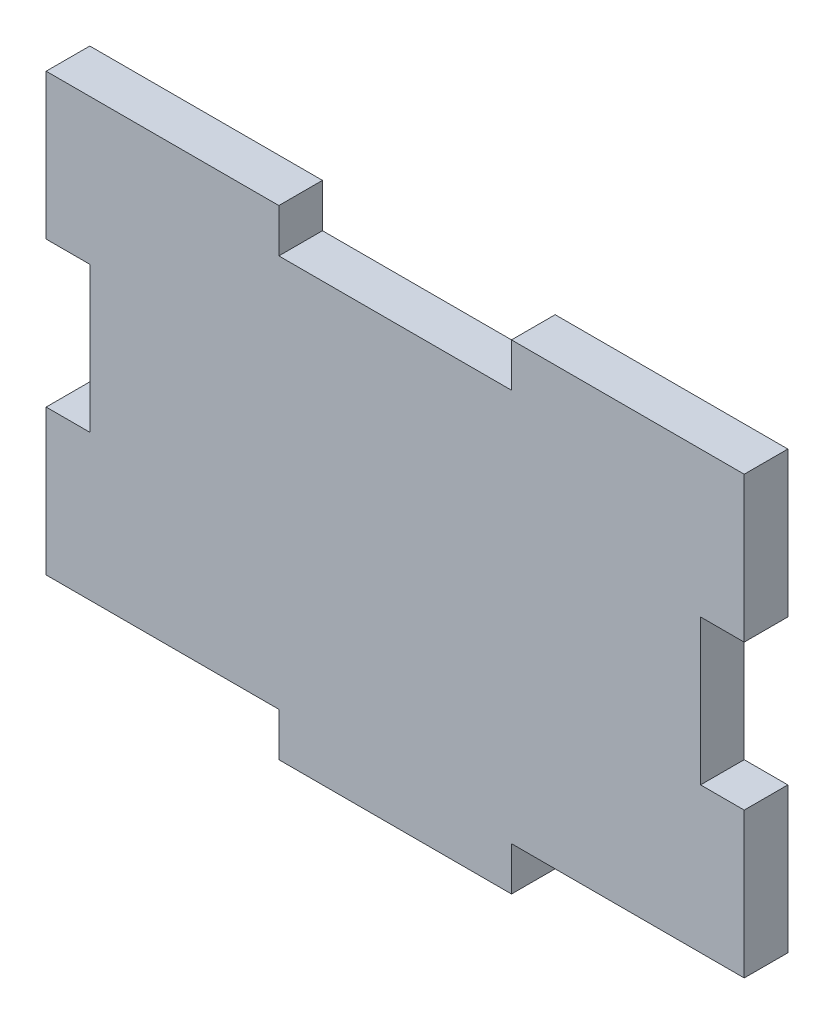
ISO-10303-21;
HEADER;
FILE_DESCRIPTION(('STEP AP214'),'2;1');
FILE_NAME('part.step','',(''),(''),'','','');
FILE_SCHEMA(('AUTOMOTIVE_DESIGN { 1 0 10303 214 1 1 1 1 }'));
ENDSEC;
DATA;
#1=APPLICATION_CONTEXT('core data for automotive mechanical design processes');
#2=APPLICATION_PROTOCOL_DEFINITION('international standard','automotive_design',2000,#1);
#3=PRODUCT_CONTEXT('',#1,'mechanical');
#4=PRODUCT('Part','Part','',(#3));
#5=PRODUCT_RELATED_PRODUCT_CATEGORY('part','',(#4));
#6=PRODUCT_DEFINITION_FORMATION('','',#4);
#7=PRODUCT_DEFINITION_CONTEXT('part definition',#1,'design');
#8=PRODUCT_DEFINITION('design','',#6,#7);
#9=PRODUCT_DEFINITION_SHAPE('','',#8);
#10=(LENGTH_UNIT() NAMED_UNIT(*) SI_UNIT(.MILLI.,.METRE.));
#11=(NAMED_UNIT(*) PLANE_ANGLE_UNIT() SI_UNIT($,.RADIAN.));
#12=(NAMED_UNIT(*) SI_UNIT($,.STERADIAN.) SOLID_ANGLE_UNIT());
#13=UNCERTAINTY_MEASURE_WITH_UNIT(LENGTH_MEASURE(1.E-05),#10,'distance_accuracy_value','');
#14=(GEOMETRIC_REPRESENTATION_CONTEXT(3) GLOBAL_UNCERTAINTY_ASSIGNED_CONTEXT((#13)) GLOBAL_UNIT_ASSIGNED_CONTEXT((#10,
#11,#12)) REPRESENTATION_CONTEXT('',''));
#15=CARTESIAN_POINT('',(0.,0.,0.));
#16=DIRECTION('',(0.,0.,1.));
#17=DIRECTION('',(1.,0.,0.));
#18=AXIS2_PLACEMENT_3D('',#15,#16,#17);
#19=CARTESIAN_POINT('',(0.,55.,5.));
#20=DIRECTION('',(0.,1.,0.));
#21=DIRECTION('',(0.,0.,1.));
#22=AXIS2_PLACEMENT_3D('',#19,#20,#21);
#23=PLANE('',#22);
#24=DIRECTION('',(0.,0.,1.));
#25=VECTOR('',#24,1.);
#26=CARTESIAN_POINT('',(53.3333333333333,55.,-5.));
#27=LINE('',#26,#25);
#28=CARTESIAN_POINT('',(53.3333333333333,55.,0.));
#29=VERTEX_POINT('',#28);
#30=CARTESIAN_POINT('',(53.3333333333333,55.,5.));
#31=VERTEX_POINT('',#30);
#32=EDGE_CURVE('E296',#29,#31,#27,.T.);
#33=ORIENTED_EDGE('',*,*,#32,.T.);
#34=DIRECTION('',(1.,0.,0.));
#35=VECTOR('',#34,1.);
#36=CARTESIAN_POINT('',(0.,55.,5.));
#37=LINE('',#36,#35);
#38=CARTESIAN_POINT('',(80.,55.,5.));
#39=VERTEX_POINT('',#38);
#40=EDGE_CURVE('E182',#31,#39,#37,.T.);
#41=ORIENTED_EDGE('',*,*,#40,.T.);
#42=DIRECTION('',(0.,0.,-1.));
#43=VECTOR('',#42,1.);
#44=CARTESIAN_POINT('',(80.,55.,5.));
#45=LINE('',#44,#43);
#46=CARTESIAN_POINT('',(80.,55.,0.));
#47=VERTEX_POINT('',#46);
#48=EDGE_CURVE('E173',#39,#47,#45,.T.);
#49=ORIENTED_EDGE('',*,*,#48,.T.);
#50=DIRECTION('',(1.,0.,0.));
#51=VECTOR('',#50,1.);
#52=CARTESIAN_POINT('',(0.,55.,0.));
#53=LINE('',#52,#51);
#54=EDGE_CURVE('E232',#29,#47,#53,.T.);
#55=ORIENTED_EDGE('',*,*,#54,.F.);
#56=EDGE_LOOP('',(#33,#41,#49,#55));
#57=FACE_BOUND('',#56,.T.);
#58=ADVANCED_FACE('F35',(#57),#23,.T.);
#59=CARTESIAN_POINT('',(0.,0.,5.));
#60=DIRECTION('',(-1.,0.,0.));
#61=DIRECTION('',(0.,0.,1.));
#62=AXIS2_PLACEMENT_3D('',#59,#60,#61);
#63=PLANE('',#62);
#64=DIRECTION('',(0.,1.,0.));
#65=VECTOR('',#64,1.);
#66=CARTESIAN_POINT('',(0.,0.,0.));
#67=LINE('',#66,#65);
#68=CARTESIAN_POINT('',(0.,38.3333333333333,0.));
#69=VERTEX_POINT('',#68);
#70=CARTESIAN_POINT('',(0.,55.,0.));
#71=VERTEX_POINT('',#70);
#72=EDGE_CURVE('E196',#69,#71,#67,.T.);
#73=ORIENTED_EDGE('',*,*,#72,.F.);
#74=DIRECTION('',(0.,0.,-1.));
#75=VECTOR('',#74,1.);
#76=CARTESIAN_POINT('',(0.,38.3333333333333,5.));
#77=LINE('',#76,#75);
#78=CARTESIAN_POINT('',(0.,38.3333333333333,5.));
#79=VERTEX_POINT('',#78);
#80=EDGE_CURVE('E119',#79,#69,#77,.T.);
#81=ORIENTED_EDGE('',*,*,#80,.F.);
#82=DIRECTION('',(0.,1.,0.));
#83=VECTOR('',#82,1.);
#84=CARTESIAN_POINT('',(0.,0.,5.));
#85=LINE('',#84,#83);
#86=CARTESIAN_POINT('',(0.,55.,5.));
#87=VERTEX_POINT('',#86);
#88=EDGE_CURVE('E236',#79,#87,#85,.T.);
#89=ORIENTED_EDGE('',*,*,#88,.T.);
#90=DIRECTION('',(0.,0.,-1.));
#91=VECTOR('',#90,1.);
#92=CARTESIAN_POINT('',(0.,55.,5.));
#93=LINE('',#92,#91);
#94=EDGE_CURVE('E59',#87,#71,#93,.T.);
#95=ORIENTED_EDGE('',*,*,#94,.T.);
#96=EDGE_LOOP('',(#73,#81,#89,#95));
#97=FACE_BOUND('',#96,.T.);
#98=ADVANCED_FACE('F37',(#97),#63,.T.);
#99=CARTESIAN_POINT('',(0.,38.3333333333333,5.));
#100=DIRECTION('',(0.,1.,0.));
#101=DIRECTION('',(0.,0.,1.));
#102=AXIS2_PLACEMENT_3D('',#99,#100,#101);
#103=PLANE('',#102);
#104=DIRECTION('',(1.,0.,0.));
#105=VECTOR('',#104,1.);
#106=CARTESIAN_POINT('',(0.,38.3333333333333,0.));
#107=LINE('',#106,#105);
#108=CARTESIAN_POINT('',(5.,38.3333333333333,0.));
#109=VERTEX_POINT('',#108);
#110=EDGE_CURVE('E198',#69,#109,#107,.T.);
#111=ORIENTED_EDGE('',*,*,#110,.T.);
#112=DIRECTION('',(0.,0.,-1.));
#113=VECTOR('',#112,1.);
#114=CARTESIAN_POINT('',(5.,38.3333333333333,5.));
#115=LINE('',#114,#113);
#116=CARTESIAN_POINT('',(5.,38.3333333333333,5.));
#117=VERTEX_POINT('',#116);
#118=EDGE_CURVE('E264',#117,#109,#115,.T.);
#119=ORIENTED_EDGE('',*,*,#118,.F.);
#120=DIRECTION('',(1.,0.,0.));
#121=VECTOR('',#120,1.);
#122=CARTESIAN_POINT('',(0.,38.3333333333333,5.));
#123=LINE('',#122,#121);
#124=EDGE_CURVE('E300',#79,#117,#123,.T.);
#125=ORIENTED_EDGE('',*,*,#124,.F.);
#126=ORIENTED_EDGE('',*,*,#80,.T.);
#127=EDGE_LOOP('',(#111,#119,#125,#126));
#128=FACE_BOUND('',#127,.T.);
#129=ADVANCED_FACE('F349',(#128),#103,.F.);
#130=CARTESIAN_POINT('',(5.00000000000001,0.,5.));
#131=DIRECTION('',(1.,0.,0.));
#132=DIRECTION('',(0.,1.,0.));
#133=AXIS2_PLACEMENT_3D('',#130,#131,#132);
#134=PLANE('',#133);
#135=DIRECTION('',(0.,-1.,0.));
#136=VECTOR('',#135,1.);
#137=CARTESIAN_POINT('',(5.00000000000001,0.,0.));
#138=LINE('',#137,#136);
#139=CARTESIAN_POINT('',(5.,21.6666666666667,0.));
#140=VERTEX_POINT('',#139);
#141=EDGE_CURVE('E201',#109,#140,#138,.T.);
#142=ORIENTED_EDGE('',*,*,#141,.T.);
#143=DIRECTION('',(0.,0.,-1.));
#144=VECTOR('',#143,1.);
#145=CARTESIAN_POINT('',(5.,21.6666666666667,5.));
#146=LINE('',#145,#144);
#147=CARTESIAN_POINT('',(5.,21.6666666666667,5.));
#148=VERTEX_POINT('',#147);
#149=EDGE_CURVE('E262',#148,#140,#146,.T.);
#150=ORIENTED_EDGE('',*,*,#149,.F.);
#151=DIRECTION('',(0.,-1.,0.));
#152=VECTOR('',#151,1.);
#153=CARTESIAN_POINT('',(5.00000000000001,0.,5.));
#154=LINE('',#153,#152);
#155=EDGE_CURVE('E302',#117,#148,#154,.T.);
#156=ORIENTED_EDGE('',*,*,#155,.F.);
#157=ORIENTED_EDGE('',*,*,#118,.T.);
#158=EDGE_LOOP('',(#142,#150,#156,#157));
#159=FACE_BOUND('',#158,.T.);
#160=ADVANCED_FACE('F353',(#159),#134,.F.);
#161=CARTESIAN_POINT('',(0.,21.6666666666667,5.));
#162=DIRECTION('',(0.,1.,0.));
#163=DIRECTION('',(0.,0.,1.));
#164=AXIS2_PLACEMENT_3D('',#161,#162,#163);
#165=PLANE('',#164);
#166=DIRECTION('',(1.,0.,0.));
#167=VECTOR('',#166,1.);
#168=CARTESIAN_POINT('',(0.,21.6666666666667,0.));
#169=LINE('',#168,#167);
#170=CARTESIAN_POINT('',(0.,21.6666666666667,0.));
#171=VERTEX_POINT('',#170);
#172=EDGE_CURVE('E204',#171,#140,#169,.T.);
#173=ORIENTED_EDGE('',*,*,#172,.F.);
#174=DIRECTION('',(0.,0.,-1.));
#175=VECTOR('',#174,1.);
#176=CARTESIAN_POINT('',(0.,21.6666666666667,5.));
#177=LINE('',#176,#175);
#178=CARTESIAN_POINT('',(0.,21.6666666666667,5.));
#179=VERTEX_POINT('',#178);
#180=EDGE_CURVE('E260',#179,#171,#177,.T.);
#181=ORIENTED_EDGE('',*,*,#180,.F.);
#182=DIRECTION('',(1.,0.,0.));
#183=VECTOR('',#182,1.);
#184=CARTESIAN_POINT('',(0.,21.6666666666667,5.));
#185=LINE('',#184,#183);
#186=EDGE_CURVE('E304',#179,#148,#185,.T.);
#187=ORIENTED_EDGE('',*,*,#186,.T.);
#188=ORIENTED_EDGE('',*,*,#149,.T.);
#189=EDGE_LOOP('',(#173,#181,#187,#188));
#190=FACE_BOUND('',#189,.T.);
#191=ADVANCED_FACE('F400',(#190),#165,.T.);
#192=CARTESIAN_POINT('',(0.,0.,5.));
#193=DIRECTION('',(-1.,0.,0.));
#194=DIRECTION('',(0.,0.,1.));
#195=AXIS2_PLACEMENT_3D('',#192,#193,#194);
#196=PLANE('',#195);
#197=DIRECTION('',(0.,1.,0.));
#198=VECTOR('',#197,1.);
#199=CARTESIAN_POINT('',(0.,0.,0.));
#200=LINE('',#199,#198);
#201=CARTESIAN_POINT('',(0.,5.,0.));
#202=VERTEX_POINT('',#201);
#203=EDGE_CURVE('E207',#202,#171,#200,.T.);
#204=ORIENTED_EDGE('',*,*,#203,.F.);
#205=DIRECTION('',(0.,0.,-1.));
#206=VECTOR('',#205,1.);
#207=CARTESIAN_POINT('',(0.,5.,5.));
#208=LINE('',#207,#206);
#209=CARTESIAN_POINT('',(0.,5.,5.));
#210=VERTEX_POINT('',#209);
#211=EDGE_CURVE('E258',#210,#202,#208,.T.);
#212=ORIENTED_EDGE('',*,*,#211,.F.);
#213=DIRECTION('',(0.,1.,0.));
#214=VECTOR('',#213,1.);
#215=CARTESIAN_POINT('',(0.,0.,5.));
#216=LINE('',#215,#214);
#217=EDGE_CURVE('E307',#210,#179,#216,.T.);
#218=ORIENTED_EDGE('',*,*,#217,.T.);
#219=ORIENTED_EDGE('',*,*,#180,.T.);
#220=EDGE_LOOP('',(#204,#212,#218,#219));
#221=FACE_BOUND('',#220,.T.);
#222=ADVANCED_FACE('F397',(#221),#196,.T.);
#223=CARTESIAN_POINT('',(0.,5.,5.));
#224=DIRECTION('',(0.,1.,0.));
#225=DIRECTION('',(0.,0.,1.));
#226=AXIS2_PLACEMENT_3D('',#223,#224,#225);
#227=PLANE('',#226);
#228=DIRECTION('',(1.,0.,0.));
#229=VECTOR('',#228,1.);
#230=CARTESIAN_POINT('',(0.,5.,0.));
#231=LINE('',#230,#229);
#232=CARTESIAN_POINT('',(26.6666666666667,5.,0.));
#233=VERTEX_POINT('',#232);
#234=EDGE_CURVE('E210',#202,#233,#231,.T.);
#235=ORIENTED_EDGE('',*,*,#234,.T.);
#236=DIRECTION('',(0.,0.,-1.));
#237=VECTOR('',#236,1.);
#238=CARTESIAN_POINT('',(26.6666666666667,5.,5.));
#239=LINE('',#238,#237);
#240=CARTESIAN_POINT('',(26.6666666666667,5.,5.));
#241=VERTEX_POINT('',#240);
#242=EDGE_CURVE('E255',#241,#233,#239,.T.);
#243=ORIENTED_EDGE('',*,*,#242,.F.);
#244=DIRECTION('',(1.,0.,0.));
#245=VECTOR('',#244,1.);
#246=CARTESIAN_POINT('',(0.,5.,5.));
#247=LINE('',#246,#245);
#248=EDGE_CURVE('E310',#210,#241,#247,.T.);
#249=ORIENTED_EDGE('',*,*,#248,.F.);
#250=ORIENTED_EDGE('',*,*,#211,.T.);
#251=EDGE_LOOP('',(#235,#243,#249,#250));
#252=FACE_BOUND('',#251,.T.);
#253=ADVANCED_FACE('F385',(#252),#227,.F.);
#254=CARTESIAN_POINT('',(26.6666666666667,0.,5.));
#255=DIRECTION('',(1.,0.,0.));
#256=DIRECTION('',(0.,0.,-1.));
#257=AXIS2_PLACEMENT_3D('',#254,#255,#256);
#258=PLANE('',#257);
#259=DIRECTION('',(0.,-1.,0.));
#260=VECTOR('',#259,1.);
#261=CARTESIAN_POINT('',(26.6666666666667,0.,0.));
#262=LINE('',#261,#260);
#263=CARTESIAN_POINT('',(26.6666666666667,0.,0.));
#264=VERTEX_POINT('',#263);
#265=EDGE_CURVE('E212',#233,#264,#262,.T.);
#266=ORIENTED_EDGE('',*,*,#265,.T.);
#267=DIRECTION('',(0.,0.,-1.));
#268=VECTOR('',#267,1.);
#269=CARTESIAN_POINT('',(26.6666666666667,0.,5.));
#270=LINE('',#269,#268);
#271=CARTESIAN_POINT('',(26.6666666666667,0.,5.));
#272=VERTEX_POINT('',#271);
#273=EDGE_CURVE('E252',#272,#264,#270,.T.);
#274=ORIENTED_EDGE('',*,*,#273,.F.);
#275=DIRECTION('',(0.,-1.,0.));
#276=VECTOR('',#275,1.);
#277=CARTESIAN_POINT('',(26.6666666666667,0.,5.));
#278=LINE('',#277,#276);
#279=EDGE_CURVE('E312',#241,#272,#278,.T.);
#280=ORIENTED_EDGE('',*,*,#279,.F.);
#281=ORIENTED_EDGE('',*,*,#242,.T.);
#282=EDGE_LOOP('',(#266,#274,#280,#281));
#283=FACE_BOUND('',#282,.T.);
#284=ADVANCED_FACE('F392',(#283),#258,.F.);
#285=CARTESIAN_POINT('',(0.,0.,5.));
#286=DIRECTION('',(0.,1.,0.));
#287=DIRECTION('',(0.,0.,1.));
#288=AXIS2_PLACEMENT_3D('',#285,#286,#287);
#289=PLANE('',#288);
#290=DIRECTION('',(1.,0.,0.));
#291=VECTOR('',#290,1.);
#292=CARTESIAN_POINT('',(0.,0.,0.));
#293=LINE('',#292,#291);
#294=CARTESIAN_POINT('',(53.3333333333333,0.,0.));
#295=VERTEX_POINT('',#294);
#296=EDGE_CURVE('E215',#264,#295,#293,.T.);
#297=ORIENTED_EDGE('',*,*,#296,.T.);
#298=DIRECTION('',(0.,0.,-1.));
#299=VECTOR('',#298,1.);
#300=CARTESIAN_POINT('',(53.3333333333333,0.,5.));
#301=LINE('',#300,#299);
#302=CARTESIAN_POINT('',(53.3333333333333,0.,5.));
#303=VERTEX_POINT('',#302);
#304=EDGE_CURVE('E250',#303,#295,#301,.T.);
#305=ORIENTED_EDGE('',*,*,#304,.F.);
#306=DIRECTION('',(1.,0.,0.));
#307=VECTOR('',#306,1.);
#308=CARTESIAN_POINT('',(0.,0.,5.));
#309=LINE('',#308,#307);
#310=EDGE_CURVE('E315',#272,#303,#309,.T.);
#311=ORIENTED_EDGE('',*,*,#310,.F.);
#312=ORIENTED_EDGE('',*,*,#273,.T.);
#313=EDGE_LOOP('',(#297,#305,#311,#312));
#314=FACE_BOUND('',#313,.T.);
#315=ADVANCED_FACE('F388',(#314),#289,.F.);
#316=CARTESIAN_POINT('',(53.3333333333333,0.,5.));
#317=DIRECTION('',(1.,0.,0.));
#318=DIRECTION('',(0.,0.,-1.));
#319=AXIS2_PLACEMENT_3D('',#316,#317,#318);
#320=PLANE('',#319);
#321=DIRECTION('',(0.,-1.,0.));
#322=VECTOR('',#321,1.);
#323=CARTESIAN_POINT('',(53.3333333333333,0.,0.));
#324=LINE('',#323,#322);
#325=CARTESIAN_POINT('',(53.3333333333333,5.,0.));
#326=VERTEX_POINT('',#325);
#327=EDGE_CURVE('E218',#326,#295,#324,.T.);
#328=ORIENTED_EDGE('',*,*,#327,.F.);
#329=DIRECTION('',(0.,0.,-1.));
#330=VECTOR('',#329,1.);
#331=CARTESIAN_POINT('',(53.3333333333333,5.,5.));
#332=LINE('',#331,#330);
#333=CARTESIAN_POINT('',(53.3333333333333,5.,5.));
#334=VERTEX_POINT('',#333);
#335=EDGE_CURVE('E248',#334,#326,#332,.T.);
#336=ORIENTED_EDGE('',*,*,#335,.F.);
#337=DIRECTION('',(0.,-1.,0.));
#338=VECTOR('',#337,1.);
#339=CARTESIAN_POINT('',(53.3333333333333,0.,5.));
#340=LINE('',#339,#338);
#341=EDGE_CURVE('E317',#334,#303,#340,.T.);
#342=ORIENTED_EDGE('',*,*,#341,.T.);
#343=ORIENTED_EDGE('',*,*,#304,.T.);
#344=EDGE_LOOP('',(#328,#336,#342,#343));
#345=FACE_BOUND('',#344,.T.);
#346=ADVANCED_FACE('F383',(#345),#320,.T.);
#347=CARTESIAN_POINT('',(80.,5.,0.));
#348=VERTEX_POINT('',#347);
#349=EDGE_CURVE('E213',#326,#348,#231,.T.);
#350=ORIENTED_EDGE('',*,*,#349,.T.);
#351=DIRECTION('',(0.,0.,-1.));
#352=VECTOR('',#351,1.);
#353=CARTESIAN_POINT('',(80.,5.,5.));
#354=LINE('',#353,#352);
#355=CARTESIAN_POINT('',(80.,5.,5.));
#356=VERTEX_POINT('',#355);
#357=EDGE_CURVE('E245',#356,#348,#354,.T.);
#358=ORIENTED_EDGE('',*,*,#357,.F.);
#359=EDGE_CURVE('E313',#334,#356,#247,.T.);
#360=ORIENTED_EDGE('',*,*,#359,.F.);
#361=ORIENTED_EDGE('',*,*,#335,.T.);
#362=EDGE_LOOP('',(#350,#358,#360,#361));
#363=FACE_BOUND('',#362,.T.);
#364=ADVANCED_FACE('F379',(#363),#227,.F.);
#365=CARTESIAN_POINT('',(80.,0.,5.));
#366=DIRECTION('',(-1.,0.,0.));
#367=DIRECTION('',(0.,0.,1.));
#368=AXIS2_PLACEMENT_3D('',#365,#366,#367);
#369=PLANE('',#368);
#370=DIRECTION('',(0.,1.,0.));
#371=VECTOR('',#370,1.);
#372=CARTESIAN_POINT('',(80.,0.,0.));
#373=LINE('',#372,#371);
#374=CARTESIAN_POINT('',(80.,21.6666666666667,0.));
#375=VERTEX_POINT('',#374);
#376=EDGE_CURVE('E221',#348,#375,#373,.T.);
#377=ORIENTED_EDGE('',*,*,#376,.T.);
#378=DIRECTION('',(0.,0.,-1.));
#379=VECTOR('',#378,1.);
#380=CARTESIAN_POINT('',(80.,21.6666666666667,5.));
#381=LINE('',#380,#379);
#382=CARTESIAN_POINT('',(80.,21.6666666666667,5.));
#383=VERTEX_POINT('',#382);
#384=EDGE_CURVE('E242',#383,#375,#381,.T.);
#385=ORIENTED_EDGE('',*,*,#384,.F.);
#386=DIRECTION('',(0.,1.,0.));
#387=VECTOR('',#386,1.);
#388=CARTESIAN_POINT('',(80.,0.,5.));
#389=LINE('',#388,#387);
#390=EDGE_CURVE('E320',#356,#383,#389,.T.);
#391=ORIENTED_EDGE('',*,*,#390,.F.);
#392=ORIENTED_EDGE('',*,*,#357,.T.);
#393=EDGE_LOOP('',(#377,#385,#391,#392));
#394=FACE_BOUND('',#393,.T.);
#395=ADVANCED_FACE('F376',(#394),#369,.F.);
#396=CARTESIAN_POINT('',(0.,21.6666666666667,5.));
#397=DIRECTION('',(0.,-1.,0.));
#398=DIRECTION('',(0.,0.,-1.));
#399=AXIS2_PLACEMENT_3D('',#396,#397,#398);
#400=PLANE('',#399);
#401=DIRECTION('',(-1.,0.,0.));
#402=VECTOR('',#401,1.);
#403=CARTESIAN_POINT('',(0.,21.6666666666667,0.));
#404=LINE('',#403,#402);
#405=CARTESIAN_POINT('',(75.,21.6666666666667,0.));
#406=VERTEX_POINT('',#405);
#407=EDGE_CURVE('E223',#375,#406,#404,.T.);
#408=ORIENTED_EDGE('',*,*,#407,.T.);
#409=DIRECTION('',(0.,0.,-1.));
#410=VECTOR('',#409,1.);
#411=CARTESIAN_POINT('',(75.,21.6666666666667,5.));
#412=LINE('',#411,#410);
#413=CARTESIAN_POINT('',(75.,21.6666666666667,5.));
#414=VERTEX_POINT('',#413);
#415=EDGE_CURVE('E240',#414,#406,#412,.T.);
#416=ORIENTED_EDGE('',*,*,#415,.F.);
#417=DIRECTION('',(-1.,0.,0.));
#418=VECTOR('',#417,1.);
#419=CARTESIAN_POINT('',(0.,21.6666666666667,5.));
#420=LINE('',#419,#418);
#421=EDGE_CURVE('E190',#383,#414,#420,.T.);
#422=ORIENTED_EDGE('',*,*,#421,.F.);
#423=ORIENTED_EDGE('',*,*,#384,.T.);
#424=EDGE_LOOP('',(#408,#416,#422,#423));
#425=FACE_BOUND('',#424,.T.);
#426=ADVANCED_FACE('F326',(#425),#400,.F.);
#427=CARTESIAN_POINT('',(75.,0.,5.));
#428=DIRECTION('',(1.,0.,0.));
#429=DIRECTION('',(0.,1.,0.));
#430=AXIS2_PLACEMENT_3D('',#427,#428,#429);
#431=PLANE('',#430);
#432=DIRECTION('',(0.,-1.,0.));
#433=VECTOR('',#432,1.);
#434=CARTESIAN_POINT('',(75.,0.,0.));
#435=LINE('',#434,#433);
#436=CARTESIAN_POINT('',(75.,38.3333333333333,0.));
#437=VERTEX_POINT('',#436);
#438=EDGE_CURVE('E226',#437,#406,#435,.T.);
#439=ORIENTED_EDGE('',*,*,#438,.F.);
#440=DIRECTION('',(0.,0.,-1.));
#441=VECTOR('',#440,1.);
#442=CARTESIAN_POINT('',(75.,38.3333333333333,5.));
#443=LINE('',#442,#441);
#444=CARTESIAN_POINT('',(75.,38.3333333333333,5.));
#445=VERTEX_POINT('',#444);
#446=EDGE_CURVE('E172',#445,#437,#443,.T.);
#447=ORIENTED_EDGE('',*,*,#446,.F.);
#448=DIRECTION('',(0.,-1.,0.));
#449=VECTOR('',#448,1.);
#450=CARTESIAN_POINT('',(75.,0.,5.));
#451=LINE('',#450,#449);
#452=EDGE_CURVE('E188',#445,#414,#451,.T.);
#453=ORIENTED_EDGE('',*,*,#452,.T.);
#454=ORIENTED_EDGE('',*,*,#415,.T.);
#455=EDGE_LOOP('',(#439,#447,#453,#454));
#456=FACE_BOUND('',#455,.T.);
#457=ADVANCED_FACE('F330',(#456),#431,.T.);
#458=CARTESIAN_POINT('',(0.,38.3333333333333,5.));
#459=DIRECTION('',(0.,-1.,0.));
#460=DIRECTION('',(0.,0.,-1.));
#461=AXIS2_PLACEMENT_3D('',#458,#459,#460);
#462=PLANE('',#461);
#463=DIRECTION('',(-1.,0.,0.));
#464=VECTOR('',#463,1.);
#465=CARTESIAN_POINT('',(0.,38.3333333333333,0.));
#466=LINE('',#465,#464);
#467=CARTESIAN_POINT('',(80.,38.3333333333333,0.));
#468=VERTEX_POINT('',#467);
#469=EDGE_CURVE('E168',#468,#437,#466,.T.);
#470=ORIENTED_EDGE('',*,*,#469,.F.);
#471=DIRECTION('',(0.,0.,-1.));
#472=VECTOR('',#471,1.);
#473=CARTESIAN_POINT('',(80.,38.3333333333333,5.));
#474=LINE('',#473,#472);
#475=CARTESIAN_POINT('',(80.,38.3333333333333,5.));
#476=VERTEX_POINT('',#475);
#477=EDGE_CURVE('E162',#476,#468,#474,.T.);
#478=ORIENTED_EDGE('',*,*,#477,.F.);
#479=DIRECTION('',(-1.,0.,0.));
#480=VECTOR('',#479,1.);
#481=CARTESIAN_POINT('',(0.,38.3333333333333,5.));
#482=LINE('',#481,#480);
#483=EDGE_CURVE('E166',#476,#445,#482,.T.);
#484=ORIENTED_EDGE('',*,*,#483,.T.);
#485=ORIENTED_EDGE('',*,*,#446,.T.);
#486=EDGE_LOOP('',(#470,#478,#484,#485));
#487=FACE_BOUND('',#486,.T.);
#488=ADVANCED_FACE('F164',(#487),#462,.T.);
#489=CARTESIAN_POINT('',(80.,0.,5.));
#490=DIRECTION('',(-1.,0.,0.));
#491=DIRECTION('',(0.,0.,1.));
#492=AXIS2_PLACEMENT_3D('',#489,#490,#491);
#493=PLANE('',#492);
#494=DIRECTION('',(0.,1.,0.));
#495=VECTOR('',#494,1.);
#496=CARTESIAN_POINT('',(80.,0.,0.));
#497=LINE('',#496,#495);
#498=EDGE_CURVE('E230',#468,#47,#497,.T.);
#499=ORIENTED_EDGE('',*,*,#498,.T.);
#500=ORIENTED_EDGE('',*,*,#48,.F.);
#501=DIRECTION('',(0.,1.,0.));
#502=VECTOR('',#501,1.);
#503=CARTESIAN_POINT('',(80.,0.,5.));
#504=LINE('',#503,#502);
#505=EDGE_CURVE('E177',#476,#39,#504,.T.);
#506=ORIENTED_EDGE('',*,*,#505,.F.);
#507=ORIENTED_EDGE('',*,*,#477,.T.);
#508=EDGE_LOOP('',(#499,#500,#506,#507));
#509=FACE_BOUND('',#508,.T.);
#510=ADVANCED_FACE('F178',(#509),#493,.F.);
#511=DIRECTION('',(0.,0.,1.));
#512=VECTOR('',#511,1.);
#513=CARTESIAN_POINT('',(26.6666666666667,55.,-5.));
#514=LINE('',#513,#512);
#515=CARTESIAN_POINT('',(26.6666666666667,55.,0.));
#516=VERTEX_POINT('',#515);
#517=CARTESIAN_POINT('',(26.6666666666667,55.,5.));
#518=VERTEX_POINT('',#517);
#519=EDGE_CURVE('E289',#516,#518,#514,.T.);
#520=ORIENTED_EDGE('',*,*,#519,.F.);
#521=EDGE_CURVE('E233',#71,#516,#53,.T.);
#522=ORIENTED_EDGE('',*,*,#521,.F.);
#523=ORIENTED_EDGE('',*,*,#94,.F.);
#524=EDGE_CURVE('E194',#87,#518,#37,.T.);
#525=ORIENTED_EDGE('',*,*,#524,.T.);
#526=EDGE_LOOP('',(#520,#522,#523,#525));
#527=FACE_BOUND('',#526,.T.);
#528=ADVANCED_FACE('F344',(#527),#23,.T.);
#529=CARTESIAN_POINT('',(0.,0.,5.));
#530=DIRECTION('',(0.,0.,1.));
#531=DIRECTION('',(1.,0.,0.));
#532=AXIS2_PLACEMENT_3D('',#529,#530,#531);
#533=PLANE('',#532);
#534=DIRECTION('',(0.,1.,0.));
#535=VECTOR('',#534,1.);
#536=CARTESIAN_POINT('',(53.3333333333333,55.,5.));
#537=LINE('',#536,#535);
#538=CARTESIAN_POINT('',(53.3333333333333,50.,5.));
#539=VERTEX_POINT('',#538);
#540=EDGE_CURVE('E334',#539,#31,#537,.T.);
#541=ORIENTED_EDGE('',*,*,#540,.F.);
#542=DIRECTION('',(1.,0.,0.));
#543=VECTOR('',#542,1.);
#544=CARTESIAN_POINT('',(53.3333333333333,50.,5.));
#545=LINE('',#544,#543);
#546=CARTESIAN_POINT('',(26.6666666666667,50.,5.));
#547=VERTEX_POINT('',#546);
#548=EDGE_CURVE('E285',#547,#539,#545,.T.);
#549=ORIENTED_EDGE('',*,*,#548,.F.);
#550=DIRECTION('',(0.,-1.,0.));
#551=VECTOR('',#550,1.);
#552=CARTESIAN_POINT('',(26.6666666666667,55.,5.));
#553=LINE('',#552,#551);
#554=EDGE_CURVE('E609',#518,#547,#553,.T.);
#555=ORIENTED_EDGE('',*,*,#554,.F.);
#556=ORIENTED_EDGE('',*,*,#524,.F.);
#557=ORIENTED_EDGE('',*,*,#88,.F.);
#558=ORIENTED_EDGE('',*,*,#124,.T.);
#559=ORIENTED_EDGE('',*,*,#155,.T.);
#560=ORIENTED_EDGE('',*,*,#186,.F.);
#561=ORIENTED_EDGE('',*,*,#217,.F.);
#562=ORIENTED_EDGE('',*,*,#248,.T.);
#563=ORIENTED_EDGE('',*,*,#279,.T.);
#564=ORIENTED_EDGE('',*,*,#310,.T.);
#565=ORIENTED_EDGE('',*,*,#341,.F.);
#566=ORIENTED_EDGE('',*,*,#359,.T.);
#567=ORIENTED_EDGE('',*,*,#390,.T.);
#568=ORIENTED_EDGE('',*,*,#421,.T.);
#569=ORIENTED_EDGE('',*,*,#452,.F.);
#570=ORIENTED_EDGE('',*,*,#483,.F.);
#571=ORIENTED_EDGE('',*,*,#505,.T.);
#572=ORIENTED_EDGE('',*,*,#40,.F.);
#573=EDGE_LOOP('',(#541,#549,#555,#556,#557,#558,#559,#560,#561,#562,#563,#564,#565,#566,#567,
#568,#569,#570,#571,#572));
#574=FACE_BOUND('',#573,.T.);
#575=ADVANCED_FACE('F186',(#574),#533,.T.);
#576=CARTESIAN_POINT('',(0.,0.,0.));
#577=DIRECTION('',(0.,0.,1.));
#578=DIRECTION('',(1.,0.,0.));
#579=AXIS2_PLACEMENT_3D('',#576,#577,#578);
#580=PLANE('',#579);
#581=DIRECTION('',(1.,0.,0.));
#582=VECTOR('',#581,1.);
#583=CARTESIAN_POINT('',(0.,50.,0.));
#584=LINE('',#583,#582);
#585=CARTESIAN_POINT('',(26.6666666666667,50.,0.));
#586=VERTEX_POINT('',#585);
#587=CARTESIAN_POINT('',(53.3333333333333,50.,0.));
#588=VERTEX_POINT('',#587);
#589=EDGE_CURVE('E43',#586,#588,#584,.T.);
#590=ORIENTED_EDGE('',*,*,#589,.T.);
#591=DIRECTION('',(0.,1.,0.));
#592=VECTOR('',#591,1.);
#593=CARTESIAN_POINT('',(53.3333333333333,0.,0.));
#594=LINE('',#593,#592);
#595=EDGE_CURVE('E11',#588,#29,#594,.T.);
#596=ORIENTED_EDGE('',*,*,#595,.T.);
#597=ORIENTED_EDGE('',*,*,#54,.T.);
#598=ORIENTED_EDGE('',*,*,#498,.F.);
#599=ORIENTED_EDGE('',*,*,#469,.T.);
#600=ORIENTED_EDGE('',*,*,#438,.T.);
#601=ORIENTED_EDGE('',*,*,#407,.F.);
#602=ORIENTED_EDGE('',*,*,#376,.F.);
#603=ORIENTED_EDGE('',*,*,#349,.F.);
#604=ORIENTED_EDGE('',*,*,#327,.T.);
#605=ORIENTED_EDGE('',*,*,#296,.F.);
#606=ORIENTED_EDGE('',*,*,#265,.F.);
#607=ORIENTED_EDGE('',*,*,#234,.F.);
#608=ORIENTED_EDGE('',*,*,#203,.T.);
#609=ORIENTED_EDGE('',*,*,#172,.T.);
#610=ORIENTED_EDGE('',*,*,#141,.F.);
#611=ORIENTED_EDGE('',*,*,#110,.F.);
#612=ORIENTED_EDGE('',*,*,#72,.T.);
#613=ORIENTED_EDGE('',*,*,#521,.T.);
#614=DIRECTION('',(0.,-1.,0.));
#615=VECTOR('',#614,1.);
#616=CARTESIAN_POINT('',(26.6666666666667,0.,0.));
#617=LINE('',#616,#615);
#618=EDGE_CURVE('E268',#516,#586,#617,.T.);
#619=ORIENTED_EDGE('',*,*,#618,.T.);
#620=EDGE_LOOP('',(#590,#596,#597,#598,#599,#600,#601,#602,#603,#604,#605,#606,#607,#608,#609,
#610,#611,#612,#613,#619));
#621=FACE_BOUND('',#620,.T.);
#622=ADVANCED_FACE('F272',(#621),#580,.F.);
#623=CARTESIAN_POINT('',(53.3333333333333,55.,-5.));
#624=DIRECTION('',(1.,0.,0.));
#625=DIRECTION('',(0.,0.,-1.));
#626=AXIS2_PLACEMENT_3D('',#623,#624,#625);
#627=PLANE('',#626);
#628=DIRECTION('',(0.,0.,1.));
#629=VECTOR('',#628,1.);
#630=CARTESIAN_POINT('',(53.3333333333333,50.,-5.));
#631=LINE('',#630,#629);
#632=EDGE_CURVE('E199',#588,#539,#631,.T.);
#633=ORIENTED_EDGE('',*,*,#632,.T.);
#634=ORIENTED_EDGE('',*,*,#540,.T.);
#635=ORIENTED_EDGE('',*,*,#32,.F.);
#636=ORIENTED_EDGE('',*,*,#595,.F.);
#637=EDGE_LOOP('',(#633,#634,#635,#636));
#638=FACE_BOUND('',#637,.T.);
#639=ADVANCED_FACE('F510',(#638),#627,.F.);
#640=CARTESIAN_POINT('',(53.3333333333333,50.,-5.));
#641=DIRECTION('',(0.,-1.,0.));
#642=DIRECTION('',(0.,0.,-1.));
#643=AXIS2_PLACEMENT_3D('',#640,#641,#642);
#644=PLANE('',#643);
#645=DIRECTION('',(0.,0.,1.));
#646=VECTOR('',#645,1.);
#647=CARTESIAN_POINT('',(26.6666666666667,50.,-5.));
#648=LINE('',#647,#646);
#649=EDGE_CURVE('E50',#586,#547,#648,.T.);
#650=ORIENTED_EDGE('',*,*,#649,.T.);
#651=ORIENTED_EDGE('',*,*,#548,.T.);
#652=ORIENTED_EDGE('',*,*,#632,.F.);
#653=ORIENTED_EDGE('',*,*,#589,.F.);
#654=EDGE_LOOP('',(#650,#651,#652,#653));
#655=FACE_BOUND('',#654,.T.);
#656=ADVANCED_FACE('F279',(#655),#644,.F.);
#657=CARTESIAN_POINT('',(26.6666666666667,55.,-5.));
#658=DIRECTION('',(-1.,0.,0.));
#659=DIRECTION('',(0.,0.,1.));
#660=AXIS2_PLACEMENT_3D('',#657,#658,#659);
#661=PLANE('',#660);
#662=ORIENTED_EDGE('',*,*,#519,.T.);
#663=ORIENTED_EDGE('',*,*,#554,.T.);
#664=ORIENTED_EDGE('',*,*,#649,.F.);
#665=ORIENTED_EDGE('',*,*,#618,.F.);
#666=EDGE_LOOP('',(#662,#663,#664,#665));
#667=FACE_BOUND('',#666,.T.);
#668=ADVANCED_FACE('F342',(#667),#661,.F.);
#669=CLOSED_SHELL('',(#58,#98,#129,#160,#191,#222,#253,#284,#315,#346,#364,#395,#426,#457,#488,
#510,#528,#575,#622,#639,#656,#668));
#670=MANIFOLD_SOLID_BREP('B2',#669);
#671=ADVANCED_BREP_SHAPE_REPRESENTATION('',(#18,#670),#14);
#672=SHAPE_DEFINITION_REPRESENTATION(#9,#671);
ENDSEC;
END-ISO-10303-21;
